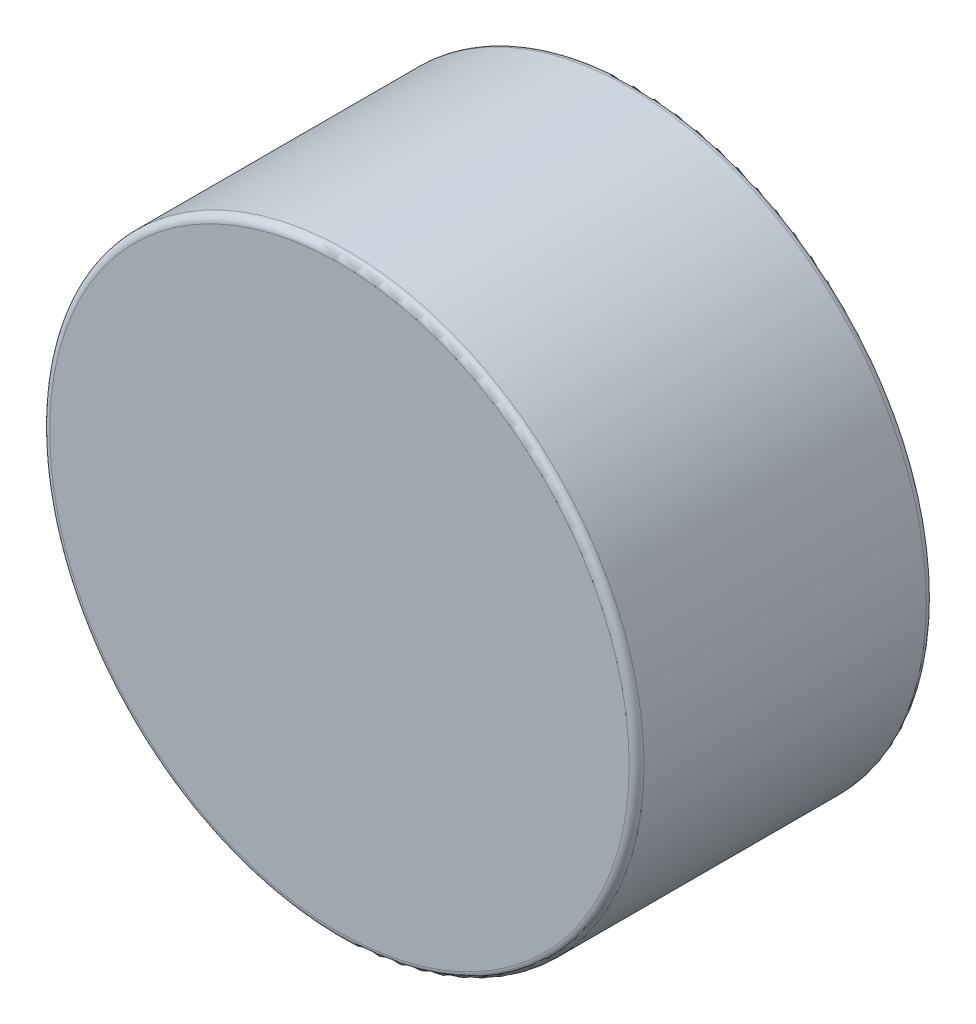
ISO-10303-21;
HEADER;
FILE_DESCRIPTION(('STEP AP214'),'2;1');
FILE_NAME('part.step','',(''),(''),'','','');
FILE_SCHEMA(('AUTOMOTIVE_DESIGN { 1 0 10303 214 1 1 1 1 }'));
ENDSEC;
DATA;
#1=APPLICATION_CONTEXT('core data for automotive mechanical design processes');
#2=APPLICATION_PROTOCOL_DEFINITION('international standard','automotive_design',2000,#1);
#3=PRODUCT_CONTEXT('',#1,'mechanical');
#4=PRODUCT('Part','Part','',(#3));
#5=PRODUCT_RELATED_PRODUCT_CATEGORY('part','',(#4));
#6=PRODUCT_DEFINITION_FORMATION('','',#4);
#7=PRODUCT_DEFINITION_CONTEXT('part definition',#1,'design');
#8=PRODUCT_DEFINITION('design','',#6,#7);
#9=PRODUCT_DEFINITION_SHAPE('','',#8);
#10=(LENGTH_UNIT() NAMED_UNIT(*) SI_UNIT(.MILLI.,.METRE.));
#11=(NAMED_UNIT(*) PLANE_ANGLE_UNIT() SI_UNIT($,.RADIAN.));
#12=(NAMED_UNIT(*) SI_UNIT($,.STERADIAN.) SOLID_ANGLE_UNIT());
#13=UNCERTAINTY_MEASURE_WITH_UNIT(LENGTH_MEASURE(1.E-05),#10,'distance_accuracy_value','');
#14=(GEOMETRIC_REPRESENTATION_CONTEXT(3) GLOBAL_UNCERTAINTY_ASSIGNED_CONTEXT((#13)) GLOBAL_UNIT_ASSIGNED_CONTEXT((#10,
#11,#12)) REPRESENTATION_CONTEXT('',''));
#15=CARTESIAN_POINT('',(0.,0.,0.));
#16=DIRECTION('',(0.,0.,1.));
#17=DIRECTION('',(1.,0.,0.));
#18=AXIS2_PLACEMENT_3D('',#15,#16,#17);
#19=CARTESIAN_POINT('',(0.,0.,0.79375));
#20=DIRECTION('',(0.,0.,-1.));
#21=DIRECTION('',(-1.,0.,0.));
#22=AXIS2_PLACEMENT_3D('',#19,#20,#21);
#23=CYLINDRICAL_SURFACE('',#22,1.5875);
#24=CARTESIAN_POINT('',(0.,0.,-0.7540625));
#25=DIRECTION('',(0.,0.,1.));
#26=DIRECTION('',(1.,0.,0.));
#27=AXIS2_PLACEMENT_3D('',#24,#25,#26);
#28=CIRCLE('',#27,1.5875);
#29=CARTESIAN_POINT('',(1.5875,0.,-0.7540625));
#30=VERTEX_POINT('',#29);
#31=EDGE_CURVE('E43',#30,#30,#28,.T.);
#32=ORIENTED_EDGE('',*,*,#31,.T.);
#33=EDGE_LOOP('',(#32));
#34=FACE_BOUND('',#33,.T.);
#35=CARTESIAN_POINT('',(0.,0.,0.7540625));
#36=DIRECTION('',(0.,0.,1.));
#37=DIRECTION('',(1.,0.,0.));
#38=AXIS2_PLACEMENT_3D('',#35,#36,#37);
#39=CIRCLE('',#38,1.5875);
#40=CARTESIAN_POINT('',(1.5875,0.,0.7540625));
#41=VERTEX_POINT('',#40);
#42=EDGE_CURVE('E47',#41,#41,#39,.F.);
#43=ORIENTED_EDGE('',*,*,#42,.T.);
#44=EDGE_LOOP('',(#43));
#45=FACE_BOUND('',#44,.T.);
#46=ADVANCED_FACE('F32',(#34,#45),#23,.T.);
#47=CARTESIAN_POINT('',(0.,0.,0.79375));
#48=DIRECTION('',(0.,0.,1.));
#49=DIRECTION('',(1.,0.,0.));
#50=AXIS2_PLACEMENT_3D('',#47,#48,#49);
#51=PLANE('',#50);
#52=CARTESIAN_POINT('',(0.,0.,0.79375));
#53=DIRECTION('',(0.,0.,1.));
#54=DIRECTION('',(1.,0.,0.));
#55=AXIS2_PLACEMENT_3D('',#52,#53,#54);
#56=CIRCLE('',#55,1.5478125);
#57=CARTESIAN_POINT('',(1.5478125,0.,0.79375));
#58=VERTEX_POINT('',#57);
#59=EDGE_CURVE('E10',#58,#58,#56,.T.);
#60=ORIENTED_EDGE('',*,*,#59,.T.);
#61=EDGE_LOOP('',(#60));
#62=FACE_BOUND('',#61,.T.);
#63=ADVANCED_FACE('F63',(#62),#51,.T.);
#64=CARTESIAN_POINT('',(0.,0.,-0.79375));
#65=DIRECTION('',(0.,0.,1.));
#66=DIRECTION('',(1.,0.,0.));
#67=AXIS2_PLACEMENT_3D('',#64,#65,#66);
#68=PLANE('',#67);
#69=CARTESIAN_POINT('',(0.,0.,-0.79375));
#70=DIRECTION('',(0.,0.,1.));
#71=DIRECTION('',(1.,0.,0.));
#72=AXIS2_PLACEMENT_3D('',#69,#70,#71);
#73=CIRCLE('',#72,1.5478125);
#74=CARTESIAN_POINT('',(1.5478125,0.,-0.79375));
#75=VERTEX_POINT('',#74);
#76=EDGE_CURVE('E39',#75,#75,#73,.F.);
#77=ORIENTED_EDGE('',*,*,#76,.T.);
#78=EDGE_LOOP('',(#77));
#79=FACE_BOUND('',#78,.T.);
#80=ADVANCED_FACE('F60',(#79),#68,.F.);
#81=CARTESIAN_POINT('',(0.,0.,-0.7540625));
#82=DIRECTION('',(0.,0.,1.));
#83=DIRECTION('',(1.,0.,0.));
#84=AXIS2_PLACEMENT_3D('',#81,#82,#83);
#85=TOROIDAL_SURFACE('',#84,1.5478125,0.0396875);
#86=ORIENTED_EDGE('',*,*,#76,.F.);
#87=EDGE_LOOP('',(#86));
#88=FACE_BOUND('',#87,.T.);
#89=ORIENTED_EDGE('',*,*,#31,.F.);
#90=EDGE_LOOP('',(#89));
#91=FACE_BOUND('',#90,.T.);
#92=ADVANCED_FACE('F56',(#88,#91),#85,.T.);
#93=CARTESIAN_POINT('',(0.,0.,0.7540625));
#94=DIRECTION('',(0.,0.,1.));
#95=DIRECTION('',(1.,0.,0.));
#96=AXIS2_PLACEMENT_3D('',#93,#94,#95);
#97=TOROIDAL_SURFACE('',#96,1.5478125,0.0396875);
#98=ORIENTED_EDGE('',*,*,#42,.F.);
#99=EDGE_LOOP('',(#98));
#100=FACE_BOUND('',#99,.T.);
#101=ORIENTED_EDGE('',*,*,#59,.F.);
#102=EDGE_LOOP('',(#101));
#103=FACE_BOUND('',#102,.T.);
#104=ADVANCED_FACE('F34',(#100,#103),#97,.T.);
#105=CLOSED_SHELL('',(#46,#63,#80,#92,#104));
#106=MANIFOLD_SOLID_BREP('B2',#105);
#107=ADVANCED_BREP_SHAPE_REPRESENTATION('',(#18,#106),#14);
#108=SHAPE_DEFINITION_REPRESENTATION(#9,#107);
ENDSEC;
END-ISO-10303-21;
